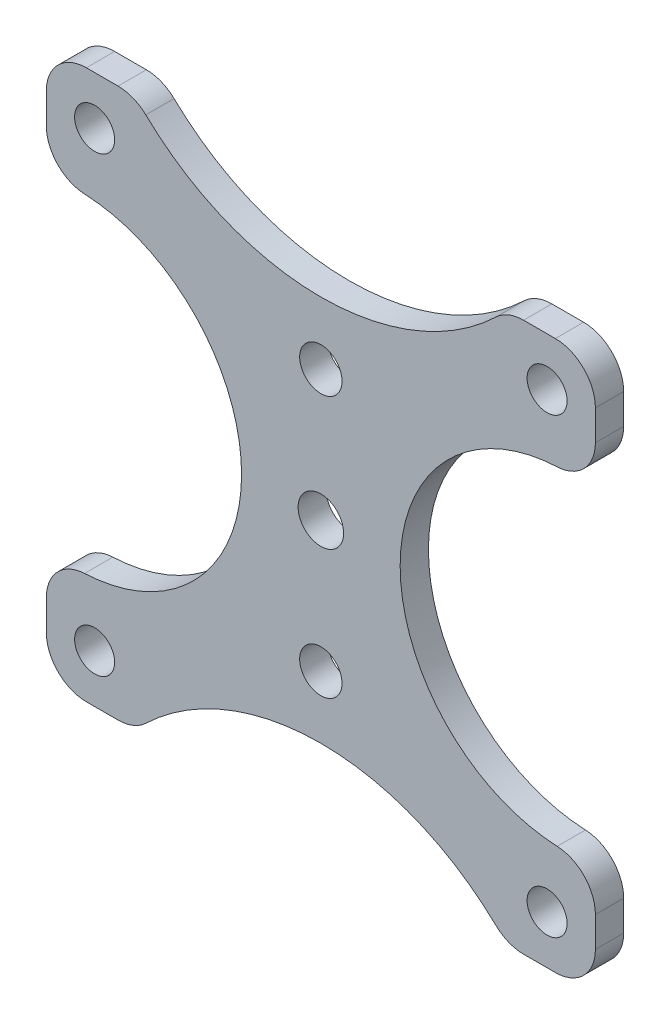
ISO-10303-21;
HEADER;
FILE_DESCRIPTION(('STEP AP214'),'2;1');
FILE_NAME('part.step','',(''),(''),'','','');
FILE_SCHEMA(('AUTOMOTIVE_DESIGN { 1 0 10303 214 1 1 1 1 }'));
ENDSEC;
DATA;
#1=APPLICATION_CONTEXT('core data for automotive mechanical design processes');
#2=APPLICATION_PROTOCOL_DEFINITION('international standard','automotive_design',2000,#1);
#3=PRODUCT_CONTEXT('',#1,'mechanical');
#4=PRODUCT('Part','Part','',(#3));
#5=PRODUCT_RELATED_PRODUCT_CATEGORY('part','',(#4));
#6=PRODUCT_DEFINITION_FORMATION('','',#4);
#7=PRODUCT_DEFINITION_CONTEXT('part definition',#1,'design');
#8=PRODUCT_DEFINITION('design','',#6,#7);
#9=PRODUCT_DEFINITION_SHAPE('','',#8);
#10=(LENGTH_UNIT() NAMED_UNIT(*) SI_UNIT(.MILLI.,.METRE.));
#11=(NAMED_UNIT(*) PLANE_ANGLE_UNIT() SI_UNIT($,.RADIAN.));
#12=(NAMED_UNIT(*) SI_UNIT($,.STERADIAN.) SOLID_ANGLE_UNIT());
#13=UNCERTAINTY_MEASURE_WITH_UNIT(LENGTH_MEASURE(1.E-05),#10,'distance_accuracy_value','');
#14=(GEOMETRIC_REPRESENTATION_CONTEXT(3) GLOBAL_UNCERTAINTY_ASSIGNED_CONTEXT((#13)) GLOBAL_UNIT_ASSIGNED_CONTEXT((#10,
#11,#12)) REPRESENTATION_CONTEXT('',''));
#15=CARTESIAN_POINT('',(0.,0.,0.));
#16=DIRECTION('',(0.,0.,1.));
#17=DIRECTION('',(1.,0.,0.));
#18=AXIS2_PLACEMENT_3D('',#15,#16,#17);
#19=CARTESIAN_POINT('',(-30.8229,-30.8229,3.175));
#20=DIRECTION('',(1.,0.,0.));
#21=DIRECTION('',(0.,0.,-1.));
#22=AXIS2_PLACEMENT_3D('',#19,#20,#21);
#23=PLANE('',#22);
#24=DIRECTION('',(0.,-1.,0.));
#25=VECTOR('',#24,1.);
#26=CARTESIAN_POINT('',(-30.8229,-30.8229,0.));
#27=LINE('',#26,#25);
#28=CARTESIAN_POINT('',(-30.8229,26.3271,0.));
#29=VERTEX_POINT('',#28);
#30=CARTESIAN_POINT('',(-30.8229,22.9379359625695,0.));
#31=VERTEX_POINT('',#30);
#32=EDGE_CURVE('E232',#29,#31,#27,.T.);
#33=ORIENTED_EDGE('',*,*,#32,.T.);
#34=DIRECTION('',(0.,0.,-1.));
#35=VECTOR('',#34,1.);
#36=CARTESIAN_POINT('',(-30.8229,22.9379359625695,3.175));
#37=LINE('',#36,#35);
#38=CARTESIAN_POINT('',(-30.8229,22.9379359625695,3.175));
#39=VERTEX_POINT('',#38);
#40=EDGE_CURVE('E296',#31,#39,#37,.F.);
#41=ORIENTED_EDGE('',*,*,#40,.T.);
#42=DIRECTION('',(0.,-1.,0.));
#43=VECTOR('',#42,1.);
#44=CARTESIAN_POINT('',(-30.8229,-30.8229,3.175));
#45=LINE('',#44,#43);
#46=CARTESIAN_POINT('',(-30.8229,26.3271,3.175));
#47=VERTEX_POINT('',#46);
#48=EDGE_CURVE('E366',#47,#39,#45,.T.);
#49=ORIENTED_EDGE('',*,*,#48,.F.);
#50=DIRECTION('',(0.,0.,-1.));
#51=VECTOR('',#50,1.);
#52=CARTESIAN_POINT('',(-30.8229,26.3271,3.175));
#53=LINE('',#52,#51);
#54=EDGE_CURVE('E208',#47,#29,#53,.T.);
#55=ORIENTED_EDGE('',*,*,#54,.T.);
#56=EDGE_LOOP('',(#33,#41,#49,#55));
#57=FACE_BOUND('',#56,.T.);
#58=ADVANCED_FACE('F36',(#57),#23,.F.);
#59=CARTESIAN_POINT('',(-30.8229,-22.9379359625695,3.175));
#60=VERTEX_POINT('',#59);
#61=CARTESIAN_POINT('',(-30.8229,-26.3271,3.175));
#62=VERTEX_POINT('',#61);
#63=EDGE_CURVE('E241',#60,#62,#45,.T.);
#64=ORIENTED_EDGE('',*,*,#63,.F.);
#65=DIRECTION('',(0.,0.,-1.));
#66=VECTOR('',#65,1.);
#67=CARTESIAN_POINT('',(-30.8229,-22.9379359625695,0.));
#68=LINE('',#67,#66);
#69=CARTESIAN_POINT('',(-30.8229,-22.9379359625695,0.));
#70=VERTEX_POINT('',#69);
#71=EDGE_CURVE('E312',#60,#70,#68,.T.);
#72=ORIENTED_EDGE('',*,*,#71,.T.);
#73=CARTESIAN_POINT('',(-30.8229,-26.3271,0.));
#74=VERTEX_POINT('',#73);
#75=EDGE_CURVE('E438',#70,#74,#27,.T.);
#76=ORIENTED_EDGE('',*,*,#75,.T.);
#77=DIRECTION('',(0.,0.,-1.));
#78=VECTOR('',#77,1.);
#79=CARTESIAN_POINT('',(-30.8229,-26.3271,3.175));
#80=LINE('',#79,#78);
#81=EDGE_CURVE('E204',#74,#62,#80,.F.);
#82=ORIENTED_EDGE('',*,*,#81,.T.);
#83=EDGE_LOOP('',(#64,#72,#76,#82));
#84=FACE_BOUND('',#83,.T.);
#85=ADVANCED_FACE('F509',(#84),#23,.F.);
#86=CARTESIAN_POINT('',(30.8229,-30.8229,3.175));
#87=DIRECTION('',(0.,1.,0.));
#88=DIRECTION('',(-1.,0.,0.));
#89=AXIS2_PLACEMENT_3D('',#86,#87,#88);
#90=PLANE('',#89);
#91=DIRECTION('',(1.,0.,0.));
#92=VECTOR('',#91,1.);
#93=CARTESIAN_POINT('',(30.8229,-30.8229,0.));
#94=LINE('',#93,#92);
#95=CARTESIAN_POINT('',(-26.3271,-30.8229,0.));
#96=VERTEX_POINT('',#95);
#97=CARTESIAN_POINT('',(-22.7631511198609,-30.8229,0.));
#98=VERTEX_POINT('',#97);
#99=EDGE_CURVE('E215',#96,#98,#94,.T.);
#100=ORIENTED_EDGE('',*,*,#99,.T.);
#101=DIRECTION('',(0.,0.,-1.));
#102=VECTOR('',#101,1.);
#103=CARTESIAN_POINT('',(-22.7631511198609,-30.8229,3.175));
#104=LINE('',#103,#102);
#105=CARTESIAN_POINT('',(-22.7631511198609,-30.8229,3.175));
#106=VERTEX_POINT('',#105);
#107=EDGE_CURVE('E320',#98,#106,#104,.F.);
#108=ORIENTED_EDGE('',*,*,#107,.T.);
#109=DIRECTION('',(1.,0.,0.));
#110=VECTOR('',#109,1.);
#111=CARTESIAN_POINT('',(30.8229,-30.8229,3.175));
#112=LINE('',#111,#110);
#113=CARTESIAN_POINT('',(-26.3271,-30.8229,3.175));
#114=VERTEX_POINT('',#113);
#115=EDGE_CURVE('E218',#114,#106,#112,.T.);
#116=ORIENTED_EDGE('',*,*,#115,.F.);
#117=DIRECTION('',(0.,0.,-1.));
#118=VECTOR('',#117,1.);
#119=CARTESIAN_POINT('',(-26.3271,-30.8229,3.175));
#120=LINE('',#119,#118);
#121=EDGE_CURVE('E202',#114,#96,#120,.T.);
#122=ORIENTED_EDGE('',*,*,#121,.T.);
#123=EDGE_LOOP('',(#100,#108,#116,#122));
#124=FACE_BOUND('',#123,.T.);
#125=ADVANCED_FACE('F214',(#124),#90,.F.);
#126=CARTESIAN_POINT('',(22.7631511198609,-30.8229,3.175));
#127=VERTEX_POINT('',#126);
#128=CARTESIAN_POINT('',(26.3271,-30.8229,3.175));
#129=VERTEX_POINT('',#128);
#130=EDGE_CURVE('E370',#127,#129,#112,.T.);
#131=ORIENTED_EDGE('',*,*,#130,.F.);
#132=DIRECTION('',(0.,0.,-1.));
#133=VECTOR('',#132,1.);
#134=CARTESIAN_POINT('',(22.7631511198609,-30.8229,0.));
#135=LINE('',#134,#133);
#136=CARTESIAN_POINT('',(22.7631511198609,-30.8229,0.));
#137=VERTEX_POINT('',#136);
#138=EDGE_CURVE('E322',#127,#137,#135,.T.);
#139=ORIENTED_EDGE('',*,*,#138,.T.);
#140=CARTESIAN_POINT('',(26.3271,-30.8229,0.));
#141=VERTEX_POINT('',#140);
#142=EDGE_CURVE('E228',#137,#141,#94,.T.);
#143=ORIENTED_EDGE('',*,*,#142,.T.);
#144=DIRECTION('',(0.,0.,-1.));
#145=VECTOR('',#144,1.);
#146=CARTESIAN_POINT('',(26.3271,-30.8229,3.175));
#147=LINE('',#146,#145);
#148=EDGE_CURVE('E220',#141,#129,#147,.F.);
#149=ORIENTED_EDGE('',*,*,#148,.T.);
#150=EDGE_LOOP('',(#131,#139,#143,#149));
#151=FACE_BOUND('',#150,.T.);
#152=ADVANCED_FACE('F580',(#151),#90,.F.);
#153=CARTESIAN_POINT('',(30.8229,30.8229,3.175));
#154=DIRECTION('',(-1.,0.,0.));
#155=DIRECTION('',(0.,-1.,0.));
#156=AXIS2_PLACEMENT_3D('',#153,#154,#155);
#157=PLANE('',#156);
#158=DIRECTION('',(0.,1.,0.));
#159=VECTOR('',#158,1.);
#160=CARTESIAN_POINT('',(30.8229,30.8229,0.));
#161=LINE('',#160,#159);
#162=CARTESIAN_POINT('',(30.8229,-26.3271,0.));
#163=VERTEX_POINT('',#162);
#164=CARTESIAN_POINT('',(30.8229,-22.9379359625695,0.));
#165=VERTEX_POINT('',#164);
#166=EDGE_CURVE('E230',#163,#165,#161,.T.);
#167=ORIENTED_EDGE('',*,*,#166,.T.);
#168=DIRECTION('',(0.,0.,1.));
#169=VECTOR('',#168,1.);
#170=CARTESIAN_POINT('',(30.8229,-22.9379359625695,3.175));
#171=LINE('',#170,#169);
#172=CARTESIAN_POINT('',(30.8229,-22.9379359625695,3.175));
#173=VERTEX_POINT('',#172);
#174=EDGE_CURVE('E324',#165,#173,#171,.T.);
#175=ORIENTED_EDGE('',*,*,#174,.T.);
#176=DIRECTION('',(0.,1.,0.));
#177=VECTOR('',#176,1.);
#178=CARTESIAN_POINT('',(30.8229,30.8229,3.175));
#179=LINE('',#178,#177);
#180=CARTESIAN_POINT('',(30.8229,-26.3271,3.175));
#181=VERTEX_POINT('',#180);
#182=EDGE_CURVE('E378',#181,#173,#179,.T.);
#183=ORIENTED_EDGE('',*,*,#182,.F.);
#184=DIRECTION('',(0.,0.,-1.));
#185=VECTOR('',#184,1.);
#186=CARTESIAN_POINT('',(30.8229,-26.3271,3.175));
#187=LINE('',#186,#185);
#188=EDGE_CURVE('E266',#181,#163,#187,.T.);
#189=ORIENTED_EDGE('',*,*,#188,.T.);
#190=EDGE_LOOP('',(#167,#175,#183,#189));
#191=FACE_BOUND('',#190,.T.);
#192=ADVANCED_FACE('F476',(#191),#157,.F.);
#193=CARTESIAN_POINT('',(-30.8229,30.8229,3.175));
#194=DIRECTION('',(0.,-1.,0.));
#195=DIRECTION('',(0.,0.,-1.));
#196=AXIS2_PLACEMENT_3D('',#193,#194,#195);
#197=PLANE('',#196);
#198=DIRECTION('',(-1.,0.,0.));
#199=VECTOR('',#198,1.);
#200=CARTESIAN_POINT('',(-30.8229,30.8229,0.));
#201=LINE('',#200,#199);
#202=CARTESIAN_POINT('',(26.3271,30.8229,0.));
#203=VERTEX_POINT('',#202);
#204=CARTESIAN_POINT('',(22.7631511198609,30.8229,0.));
#205=VERTEX_POINT('',#204);
#206=EDGE_CURVE('E238',#203,#205,#201,.T.);
#207=ORIENTED_EDGE('',*,*,#206,.T.);
#208=DIRECTION('',(0.,0.,1.));
#209=VECTOR('',#208,1.);
#210=CARTESIAN_POINT('',(22.7631511198609,30.8229,3.175));
#211=LINE('',#210,#209);
#212=CARTESIAN_POINT('',(22.7631511198609,30.8229,3.175));
#213=VERTEX_POINT('',#212);
#214=EDGE_CURVE('E11',#205,#213,#211,.T.);
#215=ORIENTED_EDGE('',*,*,#214,.T.);
#216=DIRECTION('',(-1.,0.,0.));
#217=VECTOR('',#216,1.);
#218=CARTESIAN_POINT('',(-30.8229,30.8229,3.175));
#219=LINE('',#218,#217);
#220=CARTESIAN_POINT('',(26.3271,30.8229,3.175));
#221=VERTEX_POINT('',#220);
#222=EDGE_CURVE('E243',#221,#213,#219,.T.);
#223=ORIENTED_EDGE('',*,*,#222,.F.);
#224=DIRECTION('',(0.,0.,-1.));
#225=VECTOR('',#224,1.);
#226=CARTESIAN_POINT('',(26.3271,30.8229,3.175));
#227=LINE('',#226,#225);
#228=EDGE_CURVE('E272',#221,#203,#227,.T.);
#229=ORIENTED_EDGE('',*,*,#228,.T.);
#230=EDGE_LOOP('',(#207,#215,#223,#229));
#231=FACE_BOUND('',#230,.T.);
#232=ADVANCED_FACE('F384',(#231),#197,.F.);
#233=CARTESIAN_POINT('',(30.8229,22.9379359625695,3.175));
#234=VERTEX_POINT('',#233);
#235=CARTESIAN_POINT('',(30.8229,26.3271,3.175));
#236=VERTEX_POINT('',#235);
#237=EDGE_CURVE('E377',#234,#236,#179,.T.);
#238=ORIENTED_EDGE('',*,*,#237,.F.);
#239=DIRECTION('',(0.,0.,1.));
#240=VECTOR('',#239,1.);
#241=CARTESIAN_POINT('',(30.8229,22.9379359625695,3.175));
#242=LINE('',#241,#240);
#243=CARTESIAN_POINT('',(30.8229,22.9379359625695,0.));
#244=VERTEX_POINT('',#243);
#245=EDGE_CURVE('E331',#234,#244,#242,.F.);
#246=ORIENTED_EDGE('',*,*,#245,.T.);
#247=CARTESIAN_POINT('',(30.8229,26.3271,0.));
#248=VERTEX_POINT('',#247);
#249=EDGE_CURVE('E227',#244,#248,#161,.T.);
#250=ORIENTED_EDGE('',*,*,#249,.T.);
#251=DIRECTION('',(0.,0.,-1.));
#252=VECTOR('',#251,1.);
#253=CARTESIAN_POINT('',(30.8229,26.3271,3.175));
#254=LINE('',#253,#252);
#255=EDGE_CURVE('E263',#248,#236,#254,.F.);
#256=ORIENTED_EDGE('',*,*,#255,.T.);
#257=EDGE_LOOP('',(#238,#246,#250,#256));
#258=FACE_BOUND('',#257,.T.);
#259=ADVANCED_FACE('F572',(#258),#157,.F.);
#260=CARTESIAN_POINT('',(-22.7631511198609,30.8229,3.175));
#261=VERTEX_POINT('',#260);
#262=CARTESIAN_POINT('',(-26.3271,30.8229,3.175));
#263=VERTEX_POINT('',#262);
#264=EDGE_CURVE('E357',#261,#263,#219,.T.);
#265=ORIENTED_EDGE('',*,*,#264,.F.);
#266=DIRECTION('',(0.,0.,1.));
#267=VECTOR('',#266,1.);
#268=CARTESIAN_POINT('',(-22.7631511198609,30.8229,3.175));
#269=LINE('',#268,#267);
#270=CARTESIAN_POINT('',(-22.7631511198609,30.8229,0.));
#271=VERTEX_POINT('',#270);
#272=EDGE_CURVE('E334',#261,#271,#269,.F.);
#273=ORIENTED_EDGE('',*,*,#272,.T.);
#274=CARTESIAN_POINT('',(-26.3271,30.8229,0.));
#275=VERTEX_POINT('',#274);
#276=EDGE_CURVE('E237',#271,#275,#201,.T.);
#277=ORIENTED_EDGE('',*,*,#276,.T.);
#278=DIRECTION('',(0.,0.,-1.));
#279=VECTOR('',#278,1.);
#280=CARTESIAN_POINT('',(-26.3271,30.8229,3.175));
#281=LINE('',#280,#279);
#282=EDGE_CURVE('E269',#275,#263,#281,.F.);
#283=ORIENTED_EDGE('',*,*,#282,.T.);
#284=EDGE_LOOP('',(#265,#273,#277,#283));
#285=FACE_BOUND('',#284,.T.);
#286=ADVANCED_FACE('F356',(#285),#197,.F.);
#287=CARTESIAN_POINT('',(0.,0.,3.175));
#288=DIRECTION('',(0.,0.,-1.));
#289=DIRECTION('',(-1.,0.,0.));
#290=AXIS2_PLACEMENT_3D('',#287,#288,#289);
#291=PLANE('',#290);
#292=ORIENTED_EDGE('',*,*,#48,.T.);
#293=CARTESIAN_POINT('',(-26.3271,22.9379359625695,3.175));
#294=DIRECTION('',(0.,0.,-1.));
#295=DIRECTION('',(-1.,0.,0.));
#296=AXIS2_PLACEMENT_3D('',#293,#294,#295);
#297=CIRCLE('',#296,4.4958);
#298=CARTESIAN_POINT('',(-26.5309953800758,18.446761916289,3.175));
#299=VERTEX_POINT('',#298);
#300=EDGE_CURVE('E310',#39,#299,#297,.F.);
#301=ORIENTED_EDGE('',*,*,#300,.T.);
#302=CARTESIAN_POINT('',(-27.3684622636413,0.,3.175));
#303=DIRECTION('',(0.,0.,-1.));
#304=DIRECTION('',(-1.,0.,0.));
#305=AXIS2_PLACEMENT_3D('',#302,#303,#304);
#306=CIRCLE('',#305,18.4657622636413);
#307=CARTESIAN_POINT('',(-26.5309953800758,-18.446761916289,3.175));
#308=VERTEX_POINT('',#307);
#309=EDGE_CURVE('E447',#299,#308,#306,.T.);
#310=ORIENTED_EDGE('',*,*,#309,.T.);
#311=CARTESIAN_POINT('',(-26.3271,-22.9379359625695,3.175));
#312=DIRECTION('',(0.,0.,-1.));
#313=DIRECTION('',(-1.,0.,0.));
#314=AXIS2_PLACEMENT_3D('',#311,#312,#313);
#315=CIRCLE('',#314,4.4958);
#316=EDGE_CURVE('E308',#308,#60,#315,.F.);
#317=ORIENTED_EDGE('',*,*,#316,.T.);
#318=ORIENTED_EDGE('',*,*,#63,.T.);
#319=CARTESIAN_POINT('',(-26.3271,-26.3271,3.175));
#320=DIRECTION('',(0.,0.,-1.));
#321=DIRECTION('',(-1.,0.,0.));
#322=AXIS2_PLACEMENT_3D('',#319,#320,#321);
#323=CIRCLE('',#322,4.4958);
#324=EDGE_CURVE('E261',#62,#114,#323,.F.);
#325=ORIENTED_EDGE('',*,*,#324,.T.);
#326=ORIENTED_EDGE('',*,*,#115,.T.);
#327=CARTESIAN_POINT('',(-22.7631511198609,-26.3271,3.175));
#328=DIRECTION('',(0.,0.,-1.));
#329=DIRECTION('',(-1.,0.,0.));
#330=AXIS2_PLACEMENT_3D('',#327,#328,#329);
#331=CIRCLE('',#330,4.4958);
#332=CARTESIAN_POINT('',(-19.6571216866755,-29.5774536423266,3.175));
#333=VERTEX_POINT('',#332);
#334=EDGE_CURVE('E306',#106,#333,#331,.F.);
#335=ORIENTED_EDGE('',*,*,#334,.T.);
#336=CARTESIAN_POINT('',(0.,-50.1479596360243,3.175));
#337=DIRECTION('',(0.,0.,-1.));
#338=DIRECTION('',(1.,0.,0.));
#339=AXIS2_PLACEMENT_3D('',#336,#337,#338);
#340=CIRCLE('',#339,28.4525596360243);
#341=CARTESIAN_POINT('',(19.6571216866754,-29.5774536423266,3.175));
#342=VERTEX_POINT('',#341);
#343=EDGE_CURVE('E454',#333,#342,#340,.T.);
#344=ORIENTED_EDGE('',*,*,#343,.T.);
#345=CARTESIAN_POINT('',(22.7631511198609,-26.3271,3.175));
#346=DIRECTION('',(0.,0.,-1.));
#347=DIRECTION('',(-1.,0.,0.));
#348=AXIS2_PLACEMENT_3D('',#345,#346,#347);
#349=CIRCLE('',#348,4.4958);
#350=EDGE_CURVE('E304',#342,#127,#349,.F.);
#351=ORIENTED_EDGE('',*,*,#350,.T.);
#352=ORIENTED_EDGE('',*,*,#130,.T.);
#353=CARTESIAN_POINT('',(26.3271,-26.3271,3.175));
#354=DIRECTION('',(0.,0.,-1.));
#355=DIRECTION('',(-1.,0.,0.));
#356=AXIS2_PLACEMENT_3D('',#353,#354,#355);
#357=CIRCLE('',#356,4.4958);
#358=EDGE_CURVE('E259',#129,#181,#357,.F.);
#359=ORIENTED_EDGE('',*,*,#358,.T.);
#360=ORIENTED_EDGE('',*,*,#182,.T.);
#361=CARTESIAN_POINT('',(26.3271,-22.9379359625695,3.175));
#362=DIRECTION('',(0.,0.,-1.));
#363=DIRECTION('',(-1.,0.,0.));
#364=AXIS2_PLACEMENT_3D('',#361,#362,#363);
#365=CIRCLE('',#364,4.4958);
#366=CARTESIAN_POINT('',(26.5309953800758,-18.446761916289,3.175));
#367=VERTEX_POINT('',#366);
#368=EDGE_CURVE('E302',#173,#367,#365,.F.);
#369=ORIENTED_EDGE('',*,*,#368,.T.);
#370=CARTESIAN_POINT('',(27.3684622636413,0.,3.175));
#371=DIRECTION('',(0.,0.,1.));
#372=DIRECTION('',(1.,0.,0.));
#373=AXIS2_PLACEMENT_3D('',#370,#371,#372);
#374=CIRCLE('',#373,18.4657622636413);
#375=CARTESIAN_POINT('',(26.5309953800758,18.446761916289,3.175));
#376=VERTEX_POINT('',#375);
#377=EDGE_CURVE('E399',#376,#367,#374,.T.);
#378=ORIENTED_EDGE('',*,*,#377,.F.);
#379=CARTESIAN_POINT('',(26.3271,22.9379359625695,3.175));
#380=DIRECTION('',(0.,0.,-1.));
#381=DIRECTION('',(-1.,0.,0.));
#382=AXIS2_PLACEMENT_3D('',#379,#380,#381);
#383=CIRCLE('',#382,4.4958);
#384=EDGE_CURVE('E300',#376,#234,#383,.F.);
#385=ORIENTED_EDGE('',*,*,#384,.T.);
#386=ORIENTED_EDGE('',*,*,#237,.T.);
#387=CARTESIAN_POINT('',(26.3271,26.3271,3.175));
#388=DIRECTION('',(0.,0.,-1.));
#389=DIRECTION('',(-1.,0.,0.));
#390=AXIS2_PLACEMENT_3D('',#387,#388,#389);
#391=CIRCLE('',#390,4.4958);
#392=EDGE_CURVE('E257',#236,#221,#391,.F.);
#393=ORIENTED_EDGE('',*,*,#392,.T.);
#394=ORIENTED_EDGE('',*,*,#222,.T.);
#395=CARTESIAN_POINT('',(22.7631511198609,26.3271,3.175));
#396=DIRECTION('',(0.,0.,-1.));
#397=DIRECTION('',(-1.,0.,0.));
#398=AXIS2_PLACEMENT_3D('',#395,#396,#397);
#399=CIRCLE('',#398,4.4958);
#400=CARTESIAN_POINT('',(19.6571216866754,29.5774536423266,3.175));
#401=VERTEX_POINT('',#400);
#402=EDGE_CURVE('E57',#213,#401,#399,.F.);
#403=ORIENTED_EDGE('',*,*,#402,.T.);
#404=CARTESIAN_POINT('',(0.,50.1479596360243,3.175));
#405=DIRECTION('',(0.,0.,1.));
#406=DIRECTION('',(1.,0.,0.));
#407=AXIS2_PLACEMENT_3D('',#404,#405,#406);
#408=CIRCLE('',#407,28.4525596360243);
#409=CARTESIAN_POINT('',(-19.6571216866754,29.5774536423266,3.175));
#410=VERTEX_POINT('',#409);
#411=EDGE_CURVE('E342',#410,#401,#408,.T.);
#412=ORIENTED_EDGE('',*,*,#411,.F.);
#413=CARTESIAN_POINT('',(-22.7631511198609,26.3271,3.175));
#414=DIRECTION('',(0.,0.,-1.));
#415=DIRECTION('',(-1.,0.,0.));
#416=AXIS2_PLACEMENT_3D('',#413,#414,#415);
#417=CIRCLE('',#416,4.4958);
#418=EDGE_CURVE('E51',#410,#261,#417,.F.);
#419=ORIENTED_EDGE('',*,*,#418,.T.);
#420=ORIENTED_EDGE('',*,*,#264,.T.);
#421=CARTESIAN_POINT('',(-26.3271,26.3271,3.175));
#422=DIRECTION('',(0.,0.,-1.));
#423=DIRECTION('',(-1.,0.,0.));
#424=AXIS2_PLACEMENT_3D('',#421,#422,#423);
#425=CIRCLE('',#424,4.4958);
#426=EDGE_CURVE('E255',#263,#47,#425,.F.);
#427=ORIENTED_EDGE('',*,*,#426,.T.);
#428=EDGE_LOOP('',(#292,#301,#310,#317,#318,#325,#326,#335,#344,#351,#352,#359,#360,#369,#378,
#385,#386,#393,#394,#403,#412,#419,#420,#427));
#429=FACE_BOUND('',#428,.T.);
#430=CARTESIAN_POINT('',(0.,0.,3.175));
#431=DIRECTION('',(0.,0.,1.));
#432=DIRECTION('',(1.,0.,0.));
#433=AXIS2_PLACEMENT_3D('',#430,#431,#432);
#434=CIRCLE('',#433,2.5527);
#435=CARTESIAN_POINT('',(2.55270000000001,0.,3.175));
#436=VERTEX_POINT('',#435);
#437=EDGE_CURVE('E393',#436,#436,#434,.T.);
#438=ORIENTED_EDGE('',*,*,#437,.F.);
#439=EDGE_LOOP('',(#438));
#440=FACE_BOUND('',#439,.T.);
#441=CARTESIAN_POINT('',(-25.4,25.4,3.175));
#442=DIRECTION('',(0.,0.,1.));
#443=DIRECTION('',(1.,0.,0.));
#444=AXIS2_PLACEMENT_3D('',#441,#442,#443);
#445=CIRCLE('',#444,2.2479);
#446=CARTESIAN_POINT('',(-23.1521,25.4,3.175));
#447=VERTEX_POINT('',#446);
#448=EDGE_CURVE('E404',#447,#447,#445,.T.);
#449=ORIENTED_EDGE('',*,*,#448,.F.);
#450=EDGE_LOOP('',(#449));
#451=FACE_BOUND('',#450,.T.);
#452=CARTESIAN_POINT('',(-25.4,-25.4,3.175));
#453=DIRECTION('',(0.,0.,1.));
#454=DIRECTION('',(1.,0.,0.));
#455=AXIS2_PLACEMENT_3D('',#452,#453,#454);
#456=CIRCLE('',#455,2.2479);
#457=CARTESIAN_POINT('',(-23.1521,-25.4,3.175));
#458=VERTEX_POINT('',#457);
#459=EDGE_CURVE('E410',#458,#458,#456,.T.);
#460=ORIENTED_EDGE('',*,*,#459,.F.);
#461=EDGE_LOOP('',(#460));
#462=FACE_BOUND('',#461,.T.);
#463=CARTESIAN_POINT('',(25.4,-25.4,3.175));
#464=DIRECTION('',(0.,0.,1.));
#465=DIRECTION('',(1.,0.,0.));
#466=AXIS2_PLACEMENT_3D('',#463,#464,#465);
#467=CIRCLE('',#466,2.2479);
#468=CARTESIAN_POINT('',(27.6479,-25.4,3.175));
#469=VERTEX_POINT('',#468);
#470=EDGE_CURVE('E416',#469,#469,#467,.T.);
#471=ORIENTED_EDGE('',*,*,#470,.F.);
#472=EDGE_LOOP('',(#471));
#473=FACE_BOUND('',#472,.T.);
#474=CARTESIAN_POINT('',(25.4,25.4,3.175));
#475=DIRECTION('',(0.,0.,1.));
#476=DIRECTION('',(1.,0.,0.));
#477=AXIS2_PLACEMENT_3D('',#474,#475,#476);
#478=CIRCLE('',#477,2.2479);
#479=CARTESIAN_POINT('',(27.6479,25.4,3.175));
#480=VERTEX_POINT('',#479);
#481=EDGE_CURVE('E422',#480,#480,#478,.T.);
#482=ORIENTED_EDGE('',*,*,#481,.F.);
#483=EDGE_LOOP('',(#482));
#484=FACE_BOUND('',#483,.T.);
#485=CARTESIAN_POINT('',(0.,-14.685,3.175));
#486=DIRECTION('',(0.,0.,1.));
#487=DIRECTION('',(1.,0.,0.));
#488=AXIS2_PLACEMENT_3D('',#485,#486,#487);
#489=CIRCLE('',#488,2.38125);
#490=CARTESIAN_POINT('',(2.38125,-14.685,3.175));
#491=VERTEX_POINT('',#490);
#492=EDGE_CURVE('E428',#491,#491,#489,.T.);
#493=ORIENTED_EDGE('',*,*,#492,.F.);
#494=EDGE_LOOP('',(#493));
#495=FACE_BOUND('',#494,.T.);
#496=CARTESIAN_POINT('',(0.,14.685,3.175));
#497=DIRECTION('',(0.,0.,1.));
#498=DIRECTION('',(1.,0.,0.));
#499=AXIS2_PLACEMENT_3D('',#496,#497,#498);
#500=CIRCLE('',#499,2.38125);
#501=CARTESIAN_POINT('',(2.38125,14.685,3.175));
#502=VERTEX_POINT('',#501);
#503=EDGE_CURVE('E433',#502,#502,#500,.T.);
#504=ORIENTED_EDGE('',*,*,#503,.F.);
#505=EDGE_LOOP('',(#504));
#506=FACE_BOUND('',#505,.T.);
#507=ADVANCED_FACE('F348',(#429,#440,#451,#462,#473,#484,#495,#506),#291,.F.);
#508=CARTESIAN_POINT('',(0.,0.,0.));
#509=DIRECTION('',(0.,0.,-1.));
#510=DIRECTION('',(-1.,0.,0.));
#511=AXIS2_PLACEMENT_3D('',#508,#509,#510);
#512=PLANE('',#511);
#513=CARTESIAN_POINT('',(-27.3684622636413,0.,0.));
#514=DIRECTION('',(0.,0.,-1.));
#515=DIRECTION('',(-1.,0.,0.));
#516=AXIS2_PLACEMENT_3D('',#513,#514,#515);
#517=CIRCLE('',#516,18.4657622636413);
#518=CARTESIAN_POINT('',(-26.5309953800758,18.446761916289,0.));
#519=VERTEX_POINT('',#518);
#520=CARTESIAN_POINT('',(-26.5309953800758,-18.446761916289,0.));
#521=VERTEX_POINT('',#520);
#522=EDGE_CURVE('E452',#519,#521,#517,.T.);
#523=ORIENTED_EDGE('',*,*,#522,.F.);
#524=CARTESIAN_POINT('',(-26.3271,22.9379359625695,0.));
#525=DIRECTION('',(0.,0.,-1.));
#526=DIRECTION('',(-1.,0.,0.));
#527=AXIS2_PLACEMENT_3D('',#524,#525,#526);
#528=CIRCLE('',#527,4.4958);
#529=EDGE_CURVE('E294',#519,#31,#528,.T.);
#530=ORIENTED_EDGE('',*,*,#529,.T.);
#531=ORIENTED_EDGE('',*,*,#32,.F.);
#532=CARTESIAN_POINT('',(-26.3271,26.3271,0.));
#533=DIRECTION('',(0.,0.,-1.));
#534=DIRECTION('',(-1.,0.,0.));
#535=AXIS2_PLACEMENT_3D('',#532,#533,#534);
#536=CIRCLE('',#535,4.4958);
#537=EDGE_CURVE('E219',#29,#275,#536,.T.);
#538=ORIENTED_EDGE('',*,*,#537,.T.);
#539=ORIENTED_EDGE('',*,*,#276,.F.);
#540=CARTESIAN_POINT('',(-22.7631511198609,26.3271,0.));
#541=DIRECTION('',(0.,0.,-1.));
#542=DIRECTION('',(-1.,0.,0.));
#543=AXIS2_PLACEMENT_3D('',#540,#541,#542);
#544=CIRCLE('',#543,4.4958);
#545=CARTESIAN_POINT('',(-19.6571216866754,29.5774536423266,0.));
#546=VERTEX_POINT('',#545);
#547=EDGE_CURVE('E283',#271,#546,#544,.T.);
#548=ORIENTED_EDGE('',*,*,#547,.T.);
#549=CARTESIAN_POINT('',(0.,50.1479596360243,0.));
#550=DIRECTION('',(0.,0.,1.));
#551=DIRECTION('',(1.,0.,0.));
#552=AXIS2_PLACEMENT_3D('',#549,#550,#551);
#553=CIRCLE('',#552,28.4525596360243);
#554=CARTESIAN_POINT('',(19.6571216866754,29.5774536423266,0.));
#555=VERTEX_POINT('',#554);
#556=EDGE_CURVE('E345',#546,#555,#553,.T.);
#557=ORIENTED_EDGE('',*,*,#556,.T.);
#558=CARTESIAN_POINT('',(22.7631511198609,26.3271,0.));
#559=DIRECTION('',(0.,0.,-1.));
#560=DIRECTION('',(-1.,0.,0.));
#561=AXIS2_PLACEMENT_3D('',#558,#559,#560);
#562=CIRCLE('',#561,4.4958);
#563=EDGE_CURVE('E281',#555,#205,#562,.T.);
#564=ORIENTED_EDGE('',*,*,#563,.T.);
#565=ORIENTED_EDGE('',*,*,#206,.F.);
#566=CARTESIAN_POINT('',(26.3271,26.3271,0.));
#567=DIRECTION('',(0.,0.,-1.));
#568=DIRECTION('',(-1.,0.,0.));
#569=AXIS2_PLACEMENT_3D('',#566,#567,#568);
#570=CIRCLE('',#569,4.4958);
#571=EDGE_CURVE('E247',#203,#248,#570,.T.);
#572=ORIENTED_EDGE('',*,*,#571,.T.);
#573=ORIENTED_EDGE('',*,*,#249,.F.);
#574=CARTESIAN_POINT('',(26.3271,22.9379359625695,0.));
#575=DIRECTION('',(0.,0.,-1.));
#576=DIRECTION('',(-1.,0.,0.));
#577=AXIS2_PLACEMENT_3D('',#574,#575,#576);
#578=CIRCLE('',#577,4.4958);
#579=CARTESIAN_POINT('',(26.5309953800758,18.446761916289,0.));
#580=VERTEX_POINT('',#579);
#581=EDGE_CURVE('E285',#244,#580,#578,.T.);
#582=ORIENTED_EDGE('',*,*,#581,.T.);
#583=CARTESIAN_POINT('',(27.3684622636413,0.,0.));
#584=DIRECTION('',(0.,0.,1.));
#585=DIRECTION('',(1.,0.,0.));
#586=AXIS2_PLACEMENT_3D('',#583,#584,#585);
#587=CIRCLE('',#586,18.4657622636413);
#588=CARTESIAN_POINT('',(26.5309953800758,-18.446761916289,0.));
#589=VERTEX_POINT('',#588);
#590=EDGE_CURVE('E350',#580,#589,#587,.T.);
#591=ORIENTED_EDGE('',*,*,#590,.T.);
#592=CARTESIAN_POINT('',(26.3271,-22.9379359625695,0.));
#593=DIRECTION('',(0.,0.,-1.));
#594=DIRECTION('',(-1.,0.,0.));
#595=AXIS2_PLACEMENT_3D('',#592,#593,#594);
#596=CIRCLE('',#595,4.4958);
#597=EDGE_CURVE('E287',#589,#165,#596,.T.);
#598=ORIENTED_EDGE('',*,*,#597,.T.);
#599=ORIENTED_EDGE('',*,*,#166,.F.);
#600=CARTESIAN_POINT('',(26.3271,-26.3271,0.));
#601=DIRECTION('',(0.,0.,-1.));
#602=DIRECTION('',(-1.,0.,0.));
#603=AXIS2_PLACEMENT_3D('',#600,#601,#602);
#604=CIRCLE('',#603,4.4958);
#605=EDGE_CURVE('E209',#163,#141,#604,.T.);
#606=ORIENTED_EDGE('',*,*,#605,.T.);
#607=ORIENTED_EDGE('',*,*,#142,.F.);
#608=CARTESIAN_POINT('',(22.7631511198609,-26.3271,0.));
#609=DIRECTION('',(0.,0.,-1.));
#610=DIRECTION('',(-1.,0.,0.));
#611=AXIS2_PLACEMENT_3D('',#608,#609,#610);
#612=CIRCLE('',#611,4.4958);
#613=CARTESIAN_POINT('',(19.6571216866754,-29.5774536423266,0.));
#614=VERTEX_POINT('',#613);
#615=EDGE_CURVE('E289',#137,#614,#612,.T.);
#616=ORIENTED_EDGE('',*,*,#615,.T.);
#617=CARTESIAN_POINT('',(0.,-50.1479596360243,0.));
#618=DIRECTION('',(0.,0.,-1.));
#619=DIRECTION('',(1.,0.,0.));
#620=AXIS2_PLACEMENT_3D('',#617,#618,#619);
#621=CIRCLE('',#620,28.4525596360243);
#622=CARTESIAN_POINT('',(-19.6571216866755,-29.5774536423266,0.));
#623=VERTEX_POINT('',#622);
#624=EDGE_CURVE('E457',#623,#614,#621,.T.);
#625=ORIENTED_EDGE('',*,*,#624,.F.);
#626=CARTESIAN_POINT('',(-22.7631511198609,-26.3271,0.));
#627=DIRECTION('',(0.,0.,-1.));
#628=DIRECTION('',(-1.,0.,0.));
#629=AXIS2_PLACEMENT_3D('',#626,#627,#628);
#630=CIRCLE('',#629,4.4958);
#631=EDGE_CURVE('E226',#623,#98,#630,.T.);
#632=ORIENTED_EDGE('',*,*,#631,.T.);
#633=ORIENTED_EDGE('',*,*,#99,.F.);
#634=CARTESIAN_POINT('',(-26.3271,-26.3271,0.));
#635=DIRECTION('',(0.,0.,-1.));
#636=DIRECTION('',(-1.,0.,0.));
#637=AXIS2_PLACEMENT_3D('',#634,#635,#636);
#638=CIRCLE('',#637,4.4958);
#639=EDGE_CURVE('E198',#96,#74,#638,.T.);
#640=ORIENTED_EDGE('',*,*,#639,.T.);
#641=ORIENTED_EDGE('',*,*,#75,.F.);
#642=CARTESIAN_POINT('',(-26.3271,-22.9379359625695,0.));
#643=DIRECTION('',(0.,0.,-1.));
#644=DIRECTION('',(-1.,0.,0.));
#645=AXIS2_PLACEMENT_3D('',#642,#643,#644);
#646=CIRCLE('',#645,4.4958);
#647=EDGE_CURVE('E292',#70,#521,#646,.T.);
#648=ORIENTED_EDGE('',*,*,#647,.T.);
#649=EDGE_LOOP('',(#523,#530,#531,#538,#539,#548,#557,#564,#565,#572,#573,#582,#591,#598,#599,
#606,#607,#616,#625,#632,#633,#640,#641,#648));
#650=FACE_BOUND('',#649,.T.);
#651=CARTESIAN_POINT('',(0.,0.,0.));
#652=DIRECTION('',(0.,0.,1.));
#653=DIRECTION('',(1.,0.,0.));
#654=AXIS2_PLACEMENT_3D('',#651,#652,#653);
#655=CIRCLE('',#654,2.5527);
#656=CARTESIAN_POINT('',(2.55270000000001,0.,0.));
#657=VERTEX_POINT('',#656);
#658=EDGE_CURVE('E396',#657,#657,#655,.T.);
#659=ORIENTED_EDGE('',*,*,#658,.T.);
#660=EDGE_LOOP('',(#659));
#661=FACE_BOUND('',#660,.T.);
#662=CARTESIAN_POINT('',(-25.4,25.4,0.));
#663=DIRECTION('',(0.,0.,1.));
#664=DIRECTION('',(1.,0.,0.));
#665=AXIS2_PLACEMENT_3D('',#662,#663,#664);
#666=CIRCLE('',#665,2.2479);
#667=CARTESIAN_POINT('',(-23.1521,25.4,0.));
#668=VERTEX_POINT('',#667);
#669=EDGE_CURVE('E407',#668,#668,#666,.T.);
#670=ORIENTED_EDGE('',*,*,#669,.T.);
#671=EDGE_LOOP('',(#670));
#672=FACE_BOUND('',#671,.T.);
#673=CARTESIAN_POINT('',(-25.4,-25.4,0.));
#674=DIRECTION('',(0.,0.,1.));
#675=DIRECTION('',(1.,0.,0.));
#676=AXIS2_PLACEMENT_3D('',#673,#674,#675);
#677=CIRCLE('',#676,2.2479);
#678=CARTESIAN_POINT('',(-23.1521,-25.4,0.));
#679=VERTEX_POINT('',#678);
#680=EDGE_CURVE('E413',#679,#679,#677,.T.);
#681=ORIENTED_EDGE('',*,*,#680,.T.);
#682=EDGE_LOOP('',(#681));
#683=FACE_BOUND('',#682,.T.);
#684=CARTESIAN_POINT('',(25.4,-25.4,0.));
#685=DIRECTION('',(0.,0.,1.));
#686=DIRECTION('',(1.,0.,0.));
#687=AXIS2_PLACEMENT_3D('',#684,#685,#686);
#688=CIRCLE('',#687,2.2479);
#689=CARTESIAN_POINT('',(27.6479,-25.4,0.));
#690=VERTEX_POINT('',#689);
#691=EDGE_CURVE('E419',#690,#690,#688,.T.);
#692=ORIENTED_EDGE('',*,*,#691,.T.);
#693=EDGE_LOOP('',(#692));
#694=FACE_BOUND('',#693,.T.);
#695=CARTESIAN_POINT('',(25.4,25.4,0.));
#696=DIRECTION('',(0.,0.,1.));
#697=DIRECTION('',(1.,0.,0.));
#698=AXIS2_PLACEMENT_3D('',#695,#696,#697);
#699=CIRCLE('',#698,2.2479);
#700=CARTESIAN_POINT('',(27.6479,25.4,0.));
#701=VERTEX_POINT('',#700);
#702=EDGE_CURVE('E425',#701,#701,#699,.T.);
#703=ORIENTED_EDGE('',*,*,#702,.T.);
#704=EDGE_LOOP('',(#703));
#705=FACE_BOUND('',#704,.T.);
#706=CARTESIAN_POINT('',(0.,-14.685,0.));
#707=DIRECTION('',(0.,0.,1.));
#708=DIRECTION('',(1.,0.,0.));
#709=AXIS2_PLACEMENT_3D('',#706,#707,#708);
#710=CIRCLE('',#709,2.38125);
#711=CARTESIAN_POINT('',(2.38125,-14.685,0.));
#712=VERTEX_POINT('',#711);
#713=EDGE_CURVE('E431',#712,#712,#710,.T.);
#714=ORIENTED_EDGE('',*,*,#713,.T.);
#715=EDGE_LOOP('',(#714));
#716=FACE_BOUND('',#715,.T.);
#717=CARTESIAN_POINT('',(0.,14.685,0.));
#718=DIRECTION('',(0.,0.,1.));
#719=DIRECTION('',(1.,0.,0.));
#720=AXIS2_PLACEMENT_3D('',#717,#718,#719);
#721=CIRCLE('',#720,2.38125);
#722=CARTESIAN_POINT('',(2.38125,14.685,0.));
#723=VERTEX_POINT('',#722);
#724=EDGE_CURVE('E374',#723,#723,#721,.T.);
#725=ORIENTED_EDGE('',*,*,#724,.T.);
#726=EDGE_LOOP('',(#725));
#727=FACE_BOUND('',#726,.T.);
#728=ADVANCED_FACE('F223',(#650,#661,#672,#683,#694,#705,#716,#727),#512,.T.);
#729=CARTESIAN_POINT('',(0.,14.685,3.175));
#730=DIRECTION('',(0.,0.,1.));
#731=DIRECTION('',(1.,0.,0.));
#732=AXIS2_PLACEMENT_3D('',#729,#730,#731);
#733=CYLINDRICAL_SURFACE('',#732,2.38125);
#734=ORIENTED_EDGE('',*,*,#724,.F.);
#735=EDGE_LOOP('',(#734));
#736=FACE_BOUND('',#735,.T.);
#737=ORIENTED_EDGE('',*,*,#503,.T.);
#738=EDGE_LOOP('',(#737));
#739=FACE_BOUND('',#738,.T.);
#740=ADVANCED_FACE('F562',(#736,#739),#733,.F.);
#741=CARTESIAN_POINT('',(0.,-14.685,3.175));
#742=DIRECTION('',(0.,0.,1.));
#743=DIRECTION('',(1.,0.,0.));
#744=AXIS2_PLACEMENT_3D('',#741,#742,#743);
#745=CYLINDRICAL_SURFACE('',#744,2.38125);
#746=ORIENTED_EDGE('',*,*,#713,.F.);
#747=EDGE_LOOP('',(#746));
#748=FACE_BOUND('',#747,.T.);
#749=ORIENTED_EDGE('',*,*,#492,.T.);
#750=EDGE_LOOP('',(#749));
#751=FACE_BOUND('',#750,.T.);
#752=ADVANCED_FACE('F558',(#748,#751),#745,.F.);
#753=CARTESIAN_POINT('',(25.4,25.4,3.175));
#754=DIRECTION('',(0.,0.,1.));
#755=DIRECTION('',(1.,0.,0.));
#756=AXIS2_PLACEMENT_3D('',#753,#754,#755);
#757=CYLINDRICAL_SURFACE('',#756,2.2479);
#758=ORIENTED_EDGE('',*,*,#702,.F.);
#759=EDGE_LOOP('',(#758));
#760=FACE_BOUND('',#759,.T.);
#761=ORIENTED_EDGE('',*,*,#481,.T.);
#762=EDGE_LOOP('',(#761));
#763=FACE_BOUND('',#762,.T.);
#764=ADVANCED_FACE('F554',(#760,#763),#757,.F.);
#765=CARTESIAN_POINT('',(25.4,-25.4,3.175));
#766=DIRECTION('',(0.,0.,1.));
#767=DIRECTION('',(1.,0.,0.));
#768=AXIS2_PLACEMENT_3D('',#765,#766,#767);
#769=CYLINDRICAL_SURFACE('',#768,2.2479);
#770=ORIENTED_EDGE('',*,*,#691,.F.);
#771=EDGE_LOOP('',(#770));
#772=FACE_BOUND('',#771,.T.);
#773=ORIENTED_EDGE('',*,*,#470,.T.);
#774=EDGE_LOOP('',(#773));
#775=FACE_BOUND('',#774,.T.);
#776=ADVANCED_FACE('F550',(#772,#775),#769,.F.);
#777=CARTESIAN_POINT('',(-25.4,-25.4,3.175));
#778=DIRECTION('',(0.,0.,1.));
#779=DIRECTION('',(1.,0.,0.));
#780=AXIS2_PLACEMENT_3D('',#777,#778,#779);
#781=CYLINDRICAL_SURFACE('',#780,2.2479);
#782=ORIENTED_EDGE('',*,*,#680,.F.);
#783=EDGE_LOOP('',(#782));
#784=FACE_BOUND('',#783,.T.);
#785=ORIENTED_EDGE('',*,*,#459,.T.);
#786=EDGE_LOOP('',(#785));
#787=FACE_BOUND('',#786,.T.);
#788=ADVANCED_FACE('F546',(#784,#787),#781,.F.);
#789=CARTESIAN_POINT('',(-25.4,25.4,3.175));
#790=DIRECTION('',(0.,0.,1.));
#791=DIRECTION('',(1.,0.,0.));
#792=AXIS2_PLACEMENT_3D('',#789,#790,#791);
#793=CYLINDRICAL_SURFACE('',#792,2.2479);
#794=ORIENTED_EDGE('',*,*,#669,.F.);
#795=EDGE_LOOP('',(#794));
#796=FACE_BOUND('',#795,.T.);
#797=ORIENTED_EDGE('',*,*,#448,.T.);
#798=EDGE_LOOP('',(#797));
#799=FACE_BOUND('',#798,.T.);
#800=ADVANCED_FACE('F542',(#796,#799),#793,.F.);
#801=CARTESIAN_POINT('',(0.,0.,3.175));
#802=DIRECTION('',(0.,0.,1.));
#803=DIRECTION('',(1.,0.,0.));
#804=AXIS2_PLACEMENT_3D('',#801,#802,#803);
#805=CYLINDRICAL_SURFACE('',#804,2.5527);
#806=ORIENTED_EDGE('',*,*,#658,.F.);
#807=EDGE_LOOP('',(#806));
#808=FACE_BOUND('',#807,.T.);
#809=ORIENTED_EDGE('',*,*,#437,.T.);
#810=EDGE_LOOP('',(#809));
#811=FACE_BOUND('',#810,.T.);
#812=ADVANCED_FACE('F519',(#808,#811),#805,.F.);
#813=CARTESIAN_POINT('',(-26.3271,-26.3271,3.175));
#814=DIRECTION('',(0.,0.,-1.));
#815=DIRECTION('',(-1.,0.,0.));
#816=AXIS2_PLACEMENT_3D('',#813,#814,#815);
#817=CYLINDRICAL_SURFACE('',#816,4.4958);
#818=ORIENTED_EDGE('',*,*,#324,.F.);
#819=ORIENTED_EDGE('',*,*,#81,.F.);
#820=ORIENTED_EDGE('',*,*,#639,.F.);
#821=ORIENTED_EDGE('',*,*,#121,.F.);
#822=EDGE_LOOP('',(#818,#819,#820,#821));
#823=FACE_BOUND('',#822,.T.);
#824=ADVANCED_FACE('F201',(#823),#817,.T.);
#825=CARTESIAN_POINT('',(26.3271,-26.3271,3.175));
#826=DIRECTION('',(0.,0.,-1.));
#827=DIRECTION('',(-1.,0.,0.));
#828=AXIS2_PLACEMENT_3D('',#825,#826,#827);
#829=CYLINDRICAL_SURFACE('',#828,4.4958);
#830=ORIENTED_EDGE('',*,*,#358,.F.);
#831=ORIENTED_EDGE('',*,*,#148,.F.);
#832=ORIENTED_EDGE('',*,*,#605,.F.);
#833=ORIENTED_EDGE('',*,*,#188,.F.);
#834=EDGE_LOOP('',(#830,#831,#832,#833));
#835=FACE_BOUND('',#834,.T.);
#836=ADVANCED_FACE('F481',(#835),#829,.T.);
#837=CARTESIAN_POINT('',(26.3271,26.3271,3.175));
#838=DIRECTION('',(0.,0.,-1.));
#839=DIRECTION('',(-1.,0.,0.));
#840=AXIS2_PLACEMENT_3D('',#837,#838,#839);
#841=CYLINDRICAL_SURFACE('',#840,4.4958);
#842=ORIENTED_EDGE('',*,*,#392,.F.);
#843=ORIENTED_EDGE('',*,*,#255,.F.);
#844=ORIENTED_EDGE('',*,*,#571,.F.);
#845=ORIENTED_EDGE('',*,*,#228,.F.);
#846=EDGE_LOOP('',(#842,#843,#844,#845));
#847=FACE_BOUND('',#846,.T.);
#848=ADVANCED_FACE('F388',(#847),#841,.T.);
#849=CARTESIAN_POINT('',(-26.3271,26.3271,3.175));
#850=DIRECTION('',(0.,0.,-1.));
#851=DIRECTION('',(-1.,0.,0.));
#852=AXIS2_PLACEMENT_3D('',#849,#850,#851);
#853=CYLINDRICAL_SURFACE('',#852,4.4958);
#854=ORIENTED_EDGE('',*,*,#426,.F.);
#855=ORIENTED_EDGE('',*,*,#282,.F.);
#856=ORIENTED_EDGE('',*,*,#537,.F.);
#857=ORIENTED_EDGE('',*,*,#54,.F.);
#858=EDGE_LOOP('',(#854,#855,#856,#857));
#859=FACE_BOUND('',#858,.T.);
#860=ADVANCED_FACE('F364',(#859),#853,.T.);
#861=CARTESIAN_POINT('',(0.,50.1479596360243,0.));
#862=DIRECTION('',(0.,0.,1.));
#863=DIRECTION('',(1.,0.,0.));
#864=AXIS2_PLACEMENT_3D('',#861,#862,#863);
#865=CYLINDRICAL_SURFACE('',#864,28.4525596360243);
#866=ORIENTED_EDGE('',*,*,#556,.F.);
#867=DIRECTION('',(0.,0.,1.));
#868=VECTOR('',#867,1.);
#869=CARTESIAN_POINT('',(-19.6571216866754,29.5774536423266,0.));
#870=LINE('',#869,#868);
#871=EDGE_CURVE('E44',#546,#410,#870,.T.);
#872=ORIENTED_EDGE('',*,*,#871,.T.);
#873=ORIENTED_EDGE('',*,*,#411,.T.);
#874=DIRECTION('',(0.,0.,1.));
#875=VECTOR('',#874,1.);
#876=CARTESIAN_POINT('',(19.6571216866754,29.5774536423266,0.));
#877=LINE('',#876,#875);
#878=EDGE_CURVE('E337',#401,#555,#877,.F.);
#879=ORIENTED_EDGE('',*,*,#878,.T.);
#880=EDGE_LOOP('',(#866,#872,#873,#879));
#881=FACE_BOUND('',#880,.T.);
#882=ADVANCED_FACE('F341',(#881),#865,.F.);
#883=CARTESIAN_POINT('',(27.3684622636413,0.,0.));
#884=DIRECTION('',(0.,0.,1.));
#885=DIRECTION('',(1.,0.,0.));
#886=AXIS2_PLACEMENT_3D('',#883,#884,#885);
#887=CYLINDRICAL_SURFACE('',#886,18.4657622636413);
#888=ORIENTED_EDGE('',*,*,#377,.T.);
#889=DIRECTION('',(0.,0.,1.));
#890=VECTOR('',#889,1.);
#891=CARTESIAN_POINT('',(26.5309953800758,-18.446761916289,0.));
#892=LINE('',#891,#890);
#893=EDGE_CURVE('E329',#367,#589,#892,.F.);
#894=ORIENTED_EDGE('',*,*,#893,.T.);
#895=ORIENTED_EDGE('',*,*,#590,.F.);
#896=DIRECTION('',(0.,0.,1.));
#897=VECTOR('',#896,1.);
#898=CARTESIAN_POINT('',(26.5309953800758,18.446761916289,0.));
#899=LINE('',#898,#897);
#900=EDGE_CURVE('E327',#580,#376,#899,.T.);
#901=ORIENTED_EDGE('',*,*,#900,.T.);
#902=EDGE_LOOP('',(#888,#894,#895,#901));
#903=FACE_BOUND('',#902,.T.);
#904=ADVANCED_FACE('F468',(#903),#887,.F.);
#905=CARTESIAN_POINT('',(0.,-50.1479596360243,0.));
#906=DIRECTION('',(0.,0.,1.));
#907=DIRECTION('',(1.,0.,0.));
#908=AXIS2_PLACEMENT_3D('',#905,#906,#907);
#909=CYLINDRICAL_SURFACE('',#908,28.4525596360243);
#910=ORIENTED_EDGE('',*,*,#343,.F.);
#911=DIRECTION('',(0.,0.,1.));
#912=VECTOR('',#911,1.);
#913=CARTESIAN_POINT('',(-19.6571216866755,-29.5774536423266,0.));
#914=LINE('',#913,#912);
#915=EDGE_CURVE('E317',#333,#623,#914,.F.);
#916=ORIENTED_EDGE('',*,*,#915,.T.);
#917=ORIENTED_EDGE('',*,*,#624,.T.);
#918=DIRECTION('',(0.,0.,1.));
#919=VECTOR('',#918,1.);
#920=CARTESIAN_POINT('',(19.6571216866754,-29.5774536423266,0.));
#921=LINE('',#920,#919);
#922=EDGE_CURVE('E314',#614,#342,#921,.T.);
#923=ORIENTED_EDGE('',*,*,#922,.T.);
#924=EDGE_LOOP('',(#910,#916,#917,#923));
#925=FACE_BOUND('',#924,.T.);
#926=ADVANCED_FACE('F492',(#925),#909,.F.);
#927=CARTESIAN_POINT('',(-27.3684622636413,0.,0.));
#928=DIRECTION('',(0.,0.,1.));
#929=DIRECTION('',(1.,0.,0.));
#930=AXIS2_PLACEMENT_3D('',#927,#928,#929);
#931=CYLINDRICAL_SURFACE('',#930,18.4657622636413);
#932=ORIENTED_EDGE('',*,*,#309,.F.);
#933=DIRECTION('',(0.,0.,1.));
#934=VECTOR('',#933,1.);
#935=CARTESIAN_POINT('',(-26.5309953800758,18.446761916289,0.));
#936=LINE('',#935,#934);
#937=EDGE_CURVE('E278',#299,#519,#936,.F.);
#938=ORIENTED_EDGE('',*,*,#937,.T.);
#939=ORIENTED_EDGE('',*,*,#522,.T.);
#940=DIRECTION('',(0.,0.,1.));
#941=VECTOR('',#940,1.);
#942=CARTESIAN_POINT('',(-26.5309953800758,-18.446761916289,0.));
#943=LINE('',#942,#941);
#944=EDGE_CURVE('E275',#521,#308,#943,.T.);
#945=ORIENTED_EDGE('',*,*,#944,.T.);
#946=EDGE_LOOP('',(#932,#938,#939,#945));
#947=FACE_BOUND('',#946,.T.);
#948=ADVANCED_FACE('F449',(#947),#931,.F.);
#949=CARTESIAN_POINT('',(-26.3271,22.9379359625695,0.));
#950=DIRECTION('',(0.,0.,1.));
#951=DIRECTION('',(1.,0.,0.));
#952=AXIS2_PLACEMENT_3D('',#949,#950,#951);
#953=CYLINDRICAL_SURFACE('',#952,4.4958);
#954=ORIENTED_EDGE('',*,*,#300,.F.);
#955=ORIENTED_EDGE('',*,*,#40,.F.);
#956=ORIENTED_EDGE('',*,*,#529,.F.);
#957=ORIENTED_EDGE('',*,*,#937,.F.);
#958=EDGE_LOOP('',(#954,#955,#956,#957));
#959=FACE_BOUND('',#958,.T.);
#960=ADVANCED_FACE('F443',(#959),#953,.T.);
#961=CARTESIAN_POINT('',(-26.3271,-22.9379359625695,0.));
#962=DIRECTION('',(0.,0.,1.));
#963=DIRECTION('',(1.,0.,0.));
#964=AXIS2_PLACEMENT_3D('',#961,#962,#963);
#965=CYLINDRICAL_SURFACE('',#964,4.4958);
#966=ORIENTED_EDGE('',*,*,#647,.F.);
#967=ORIENTED_EDGE('',*,*,#71,.F.);
#968=ORIENTED_EDGE('',*,*,#316,.F.);
#969=ORIENTED_EDGE('',*,*,#944,.F.);
#970=EDGE_LOOP('',(#966,#967,#968,#969));
#971=FACE_BOUND('',#970,.T.);
#972=ADVANCED_FACE('F499',(#971),#965,.T.);
#973=CARTESIAN_POINT('',(-22.7631511198609,-26.3271,0.));
#974=DIRECTION('',(0.,0.,1.));
#975=DIRECTION('',(1.,0.,0.));
#976=AXIS2_PLACEMENT_3D('',#973,#974,#975);
#977=CYLINDRICAL_SURFACE('',#976,4.4958);
#978=ORIENTED_EDGE('',*,*,#334,.F.);
#979=ORIENTED_EDGE('',*,*,#107,.F.);
#980=ORIENTED_EDGE('',*,*,#631,.F.);
#981=ORIENTED_EDGE('',*,*,#915,.F.);
#982=EDGE_LOOP('',(#978,#979,#980,#981));
#983=FACE_BOUND('',#982,.T.);
#984=ADVANCED_FACE('F497',(#983),#977,.T.);
#985=CARTESIAN_POINT('',(22.7631511198609,-26.3271,0.));
#986=DIRECTION('',(0.,0.,1.));
#987=DIRECTION('',(1.,0.,0.));
#988=AXIS2_PLACEMENT_3D('',#985,#986,#987);
#989=CYLINDRICAL_SURFACE('',#988,4.4958);
#990=ORIENTED_EDGE('',*,*,#615,.F.);
#991=ORIENTED_EDGE('',*,*,#138,.F.);
#992=ORIENTED_EDGE('',*,*,#350,.F.);
#993=ORIENTED_EDGE('',*,*,#922,.F.);
#994=EDGE_LOOP('',(#990,#991,#992,#993));
#995=FACE_BOUND('',#994,.T.);
#996=ADVANCED_FACE('F489',(#995),#989,.T.);
#997=CARTESIAN_POINT('',(26.3271,-22.9379359625695,0.));
#998=DIRECTION('',(0.,0.,1.));
#999=DIRECTION('',(1.,0.,0.));
#1000=AXIS2_PLACEMENT_3D('',#997,#998,#999);
#1001=CYLINDRICAL_SURFACE('',#1000,4.4958);
#1002=ORIENTED_EDGE('',*,*,#597,.F.);
#1003=ORIENTED_EDGE('',*,*,#893,.F.);
#1004=ORIENTED_EDGE('',*,*,#368,.F.);
#1005=ORIENTED_EDGE('',*,*,#174,.F.);
#1006=EDGE_LOOP('',(#1002,#1003,#1004,#1005));
#1007=FACE_BOUND('',#1006,.T.);
#1008=ADVANCED_FACE('F472',(#1007),#1001,.T.);
#1009=CARTESIAN_POINT('',(26.3271,22.9379359625695,0.));
#1010=DIRECTION('',(0.,0.,1.));
#1011=DIRECTION('',(1.,0.,0.));
#1012=AXIS2_PLACEMENT_3D('',#1009,#1010,#1011);
#1013=CYLINDRICAL_SURFACE('',#1012,4.4958);
#1014=ORIENTED_EDGE('',*,*,#384,.F.);
#1015=ORIENTED_EDGE('',*,*,#900,.F.);
#1016=ORIENTED_EDGE('',*,*,#581,.F.);
#1017=ORIENTED_EDGE('',*,*,#245,.F.);
#1018=EDGE_LOOP('',(#1014,#1015,#1016,#1017));
#1019=FACE_BOUND('',#1018,.T.);
#1020=ADVANCED_FACE('F743',(#1019),#1013,.T.);
#1021=CARTESIAN_POINT('',(-22.7631511198609,26.3271,0.));
#1022=DIRECTION('',(0.,0.,1.));
#1023=DIRECTION('',(1.,0.,0.));
#1024=AXIS2_PLACEMENT_3D('',#1021,#1022,#1023);
#1025=CYLINDRICAL_SURFACE('',#1024,4.4958);
#1026=ORIENTED_EDGE('',*,*,#418,.F.);
#1027=ORIENTED_EDGE('',*,*,#871,.F.);
#1028=ORIENTED_EDGE('',*,*,#547,.F.);
#1029=ORIENTED_EDGE('',*,*,#272,.F.);
#1030=EDGE_LOOP('',(#1026,#1027,#1028,#1029));
#1031=FACE_BOUND('',#1030,.T.);
#1032=ADVANCED_FACE('F353',(#1031),#1025,.T.);
#1033=CARTESIAN_POINT('',(22.7631511198609,26.3271,0.));
#1034=DIRECTION('',(0.,0.,1.));
#1035=DIRECTION('',(1.,0.,0.));
#1036=AXIS2_PLACEMENT_3D('',#1033,#1034,#1035);
#1037=CYLINDRICAL_SURFACE('',#1036,4.4958);
#1038=ORIENTED_EDGE('',*,*,#563,.F.);
#1039=ORIENTED_EDGE('',*,*,#878,.F.);
#1040=ORIENTED_EDGE('',*,*,#402,.F.);
#1041=ORIENTED_EDGE('',*,*,#214,.F.);
#1042=EDGE_LOOP('',(#1038,#1039,#1040,#1041));
#1043=FACE_BOUND('',#1042,.T.);
#1044=ADVANCED_FACE('F38',(#1043),#1037,.T.);
#1045=CLOSED_SHELL('',(#58,#85,#125,#152,#192,#232,#259,#286,#507,#728,#740,#752,#764,#776,#788,
#800,#812,#824,#836,#848,#860,#882,#904,#926,#948,#960,#972,#984,#996,#1008,#1020,#1032,#1044));
#1046=MANIFOLD_SOLID_BREP('B2',#1045);
#1047=ADVANCED_BREP_SHAPE_REPRESENTATION('',(#18,#1046),#14);
#1048=SHAPE_DEFINITION_REPRESENTATION(#9,#1047);
ENDSEC;
END-ISO-10303-21;
